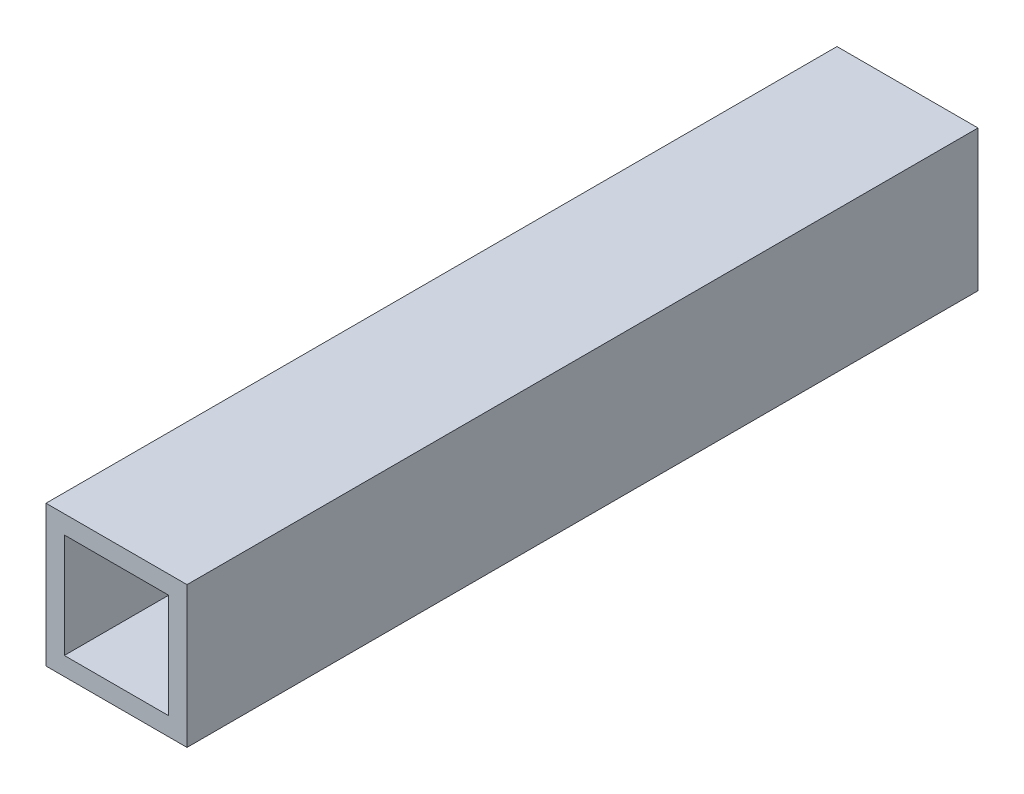
ISO-10303-21;
HEADER;
FILE_DESCRIPTION(('STEP AP214'),'2;1');
FILE_NAME('part.step','',(''),(''),'','','');
FILE_SCHEMA(('AUTOMOTIVE_DESIGN { 1 0 10303 214 1 1 1 1 }'));
ENDSEC;
DATA;
#1=APPLICATION_CONTEXT('core data for automotive mechanical design processes');
#2=APPLICATION_PROTOCOL_DEFINITION('international standard','automotive_design',2000,#1);
#3=PRODUCT_CONTEXT('',#1,'mechanical');
#4=PRODUCT('Part','Part','',(#3));
#5=PRODUCT_RELATED_PRODUCT_CATEGORY('part','',(#4));
#6=PRODUCT_DEFINITION_FORMATION('','',#4);
#7=PRODUCT_DEFINITION_CONTEXT('part definition',#1,'design');
#8=PRODUCT_DEFINITION('design','',#6,#7);
#9=PRODUCT_DEFINITION_SHAPE('','',#8);
#10=(LENGTH_UNIT() NAMED_UNIT(*) SI_UNIT(.MILLI.,.METRE.));
#11=(NAMED_UNIT(*) PLANE_ANGLE_UNIT() SI_UNIT($,.RADIAN.));
#12=(NAMED_UNIT(*) SI_UNIT($,.STERADIAN.) SOLID_ANGLE_UNIT());
#13=UNCERTAINTY_MEASURE_WITH_UNIT(LENGTH_MEASURE(1.E-05),#10,'distance_accuracy_value','');
#14=(GEOMETRIC_REPRESENTATION_CONTEXT(3) GLOBAL_UNCERTAINTY_ASSIGNED_CONTEXT((#13)) GLOBAL_UNIT_ASSIGNED_CONTEXT((#10,
#11,#12)) REPRESENTATION_CONTEXT('',''));
#15=CARTESIAN_POINT('',(0.,0.,0.));
#16=DIRECTION('',(0.,0.,1.));
#17=DIRECTION('',(1.,0.,0.));
#18=AXIS2_PLACEMENT_3D('',#15,#16,#17);
#19=CARTESIAN_POINT('',(0.,0.,71.24));
#20=DIRECTION('',(0.,0.,-1.));
#21=DIRECTION('',(-1.,0.,0.));
#22=AXIS2_PLACEMENT_3D('',#19,#20,#21);
#23=PLANE('',#22);
#24=DIRECTION('',(0.,-1.,0.));
#25=VECTOR('',#24,1.);
#26=CARTESIAN_POINT('',(-6.35,6.35,71.24));
#27=LINE('',#26,#25);
#28=CARTESIAN_POINT('',(-6.35,6.35,71.24));
#29=VERTEX_POINT('',#28);
#30=CARTESIAN_POINT('',(-6.35,-6.35,71.24));
#31=VERTEX_POINT('',#30);
#32=EDGE_CURVE('E134',#29,#31,#27,.T.);
#33=ORIENTED_EDGE('',*,*,#32,.T.);
#34=DIRECTION('',(1.,0.,0.));
#35=VECTOR('',#34,1.);
#36=CARTESIAN_POINT('',(6.35,-6.35,71.24));
#37=LINE('',#36,#35);
#38=CARTESIAN_POINT('',(6.35,-6.35,71.24));
#39=VERTEX_POINT('',#38);
#40=EDGE_CURVE('E137',#31,#39,#37,.T.);
#41=ORIENTED_EDGE('',*,*,#40,.T.);
#42=DIRECTION('',(0.,1.,0.));
#43=VECTOR('',#42,1.);
#44=CARTESIAN_POINT('',(6.35,6.35,71.24));
#45=LINE('',#44,#43);
#46=CARTESIAN_POINT('',(6.35,6.35,71.24));
#47=VERTEX_POINT('',#46);
#48=EDGE_CURVE('E140',#39,#47,#45,.T.);
#49=ORIENTED_EDGE('',*,*,#48,.T.);
#50=DIRECTION('',(-1.,0.,0.));
#51=VECTOR('',#50,1.);
#52=CARTESIAN_POINT('',(6.35,6.35,71.24));
#53=LINE('',#52,#51);
#54=EDGE_CURVE('E142',#47,#29,#53,.T.);
#55=ORIENTED_EDGE('',*,*,#54,.T.);
#56=EDGE_LOOP('',(#33,#41,#49,#55));
#57=FACE_BOUND('',#56,.T.);
#58=DIRECTION('',(0.,-1.,0.));
#59=VECTOR('',#58,1.);
#60=CARTESIAN_POINT('',(-4.7,4.7,71.24));
#61=LINE('',#60,#59);
#62=CARTESIAN_POINT('',(-4.7,4.7,71.24));
#63=VERTEX_POINT('',#62);
#64=CARTESIAN_POINT('',(-4.7,-4.7,71.24));
#65=VERTEX_POINT('',#64);
#66=EDGE_CURVE('E98',#63,#65,#61,.T.);
#67=ORIENTED_EDGE('',*,*,#66,.F.);
#68=DIRECTION('',(-1.,0.,0.));
#69=VECTOR('',#68,1.);
#70=CARTESIAN_POINT('',(4.7,4.7,71.24));
#71=LINE('',#70,#69);
#72=CARTESIAN_POINT('',(4.7,4.7,71.24));
#73=VERTEX_POINT('',#72);
#74=EDGE_CURVE('E120',#73,#63,#71,.T.);
#75=ORIENTED_EDGE('',*,*,#74,.F.);
#76=DIRECTION('',(0.,1.,0.));
#77=VECTOR('',#76,1.);
#78=CARTESIAN_POINT('',(4.7,4.7,71.24));
#79=LINE('',#78,#77);
#80=CARTESIAN_POINT('',(4.7,-4.7,71.24));
#81=VERTEX_POINT('',#80);
#82=EDGE_CURVE('E118',#81,#73,#79,.T.);
#83=ORIENTED_EDGE('',*,*,#82,.F.);
#84=DIRECTION('',(1.,0.,0.));
#85=VECTOR('',#84,1.);
#86=CARTESIAN_POINT('',(4.7,-4.7,71.24));
#87=LINE('',#86,#85);
#88=EDGE_CURVE('E106',#65,#81,#87,.T.);
#89=ORIENTED_EDGE('',*,*,#88,.F.);
#90=EDGE_LOOP('',(#67,#75,#83,#89));
#91=FACE_BOUND('',#90,.T.);
#92=ADVANCED_FACE('F33',(#57,#91),#23,.F.);
#93=CARTESIAN_POINT('',(0.,0.,0.));
#94=DIRECTION('',(0.,0.,-1.));
#95=DIRECTION('',(-1.,0.,0.));
#96=AXIS2_PLACEMENT_3D('',#93,#94,#95);
#97=PLANE('',#96);
#98=DIRECTION('',(0.,-1.,0.));
#99=VECTOR('',#98,1.);
#100=CARTESIAN_POINT('',(-6.35,6.35,0.));
#101=LINE('',#100,#99);
#102=CARTESIAN_POINT('',(-6.35,6.35,0.));
#103=VERTEX_POINT('',#102);
#104=CARTESIAN_POINT('',(-6.35,-6.35,0.));
#105=VERTEX_POINT('',#104);
#106=EDGE_CURVE('E114',#103,#105,#101,.T.);
#107=ORIENTED_EDGE('',*,*,#106,.F.);
#108=DIRECTION('',(-1.,0.,0.));
#109=VECTOR('',#108,1.);
#110=CARTESIAN_POINT('',(6.35,6.35,0.));
#111=LINE('',#110,#109);
#112=CARTESIAN_POINT('',(6.35,6.35,0.));
#113=VERTEX_POINT('',#112);
#114=EDGE_CURVE('E138',#113,#103,#111,.T.);
#115=ORIENTED_EDGE('',*,*,#114,.F.);
#116=DIRECTION('',(0.,1.,0.));
#117=VECTOR('',#116,1.);
#118=CARTESIAN_POINT('',(6.35,6.35,0.));
#119=LINE('',#118,#117);
#120=CARTESIAN_POINT('',(6.35,-6.35,0.));
#121=VERTEX_POINT('',#120);
#122=EDGE_CURVE('E149',#121,#113,#119,.T.);
#123=ORIENTED_EDGE('',*,*,#122,.F.);
#124=DIRECTION('',(1.,0.,0.));
#125=VECTOR('',#124,1.);
#126=CARTESIAN_POINT('',(6.35,-6.35,0.));
#127=LINE('',#126,#125);
#128=EDGE_CURVE('E147',#105,#121,#127,.T.);
#129=ORIENTED_EDGE('',*,*,#128,.F.);
#130=EDGE_LOOP('',(#107,#115,#123,#129));
#131=FACE_BOUND('',#130,.T.);
#132=DIRECTION('',(-1.,0.,0.));
#133=VECTOR('',#132,1.);
#134=CARTESIAN_POINT('',(4.7,4.7,0.));
#135=LINE('',#134,#133);
#136=CARTESIAN_POINT('',(4.7,4.7,0.));
#137=VERTEX_POINT('',#136);
#138=CARTESIAN_POINT('',(-4.7,4.7,0.));
#139=VERTEX_POINT('',#138);
#140=EDGE_CURVE('E107',#137,#139,#135,.T.);
#141=ORIENTED_EDGE('',*,*,#140,.T.);
#142=DIRECTION('',(0.,-1.,0.));
#143=VECTOR('',#142,1.);
#144=CARTESIAN_POINT('',(-4.7,4.7,0.));
#145=LINE('',#144,#143);
#146=CARTESIAN_POINT('',(-4.7,-4.7,0.));
#147=VERTEX_POINT('',#146);
#148=EDGE_CURVE('E56',#139,#147,#145,.T.);
#149=ORIENTED_EDGE('',*,*,#148,.T.);
#150=DIRECTION('',(1.,0.,0.));
#151=VECTOR('',#150,1.);
#152=CARTESIAN_POINT('',(4.7,-4.7,0.));
#153=LINE('',#152,#151);
#154=CARTESIAN_POINT('',(4.7,-4.7,0.));
#155=VERTEX_POINT('',#154);
#156=EDGE_CURVE('E113',#147,#155,#153,.T.);
#157=ORIENTED_EDGE('',*,*,#156,.T.);
#158=DIRECTION('',(0.,1.,0.));
#159=VECTOR('',#158,1.);
#160=CARTESIAN_POINT('',(4.7,4.7,0.));
#161=LINE('',#160,#159);
#162=EDGE_CURVE('E126',#155,#137,#161,.T.);
#163=ORIENTED_EDGE('',*,*,#162,.T.);
#164=EDGE_LOOP('',(#141,#149,#157,#163));
#165=FACE_BOUND('',#164,.T.);
#166=ADVANCED_FACE('F167',(#131,#165),#97,.T.);
#167=CARTESIAN_POINT('',(-6.35,6.35,71.24));
#168=DIRECTION('',(1.,0.,0.));
#169=DIRECTION('',(0.,1.,0.));
#170=AXIS2_PLACEMENT_3D('',#167,#168,#169);
#171=PLANE('',#170);
#172=ORIENTED_EDGE('',*,*,#106,.T.);
#173=DIRECTION('',(0.,0.,-1.));
#174=VECTOR('',#173,1.);
#175=CARTESIAN_POINT('',(-6.35,-6.35,71.24));
#176=LINE('',#175,#174);
#177=EDGE_CURVE('E11',#31,#105,#176,.T.);
#178=ORIENTED_EDGE('',*,*,#177,.F.);
#179=ORIENTED_EDGE('',*,*,#32,.F.);
#180=DIRECTION('',(0.,0.,-1.));
#181=VECTOR('',#180,1.);
#182=CARTESIAN_POINT('',(-6.35,6.35,71.24));
#183=LINE('',#182,#181);
#184=EDGE_CURVE('E144',#29,#103,#183,.T.);
#185=ORIENTED_EDGE('',*,*,#184,.T.);
#186=EDGE_LOOP('',(#172,#178,#179,#185));
#187=FACE_BOUND('',#186,.T.);
#188=ADVANCED_FACE('F35',(#187),#171,.F.);
#189=CARTESIAN_POINT('',(6.35,-6.35,71.24));
#190=DIRECTION('',(0.,1.,0.));
#191=DIRECTION('',(-1.,0.,0.));
#192=AXIS2_PLACEMENT_3D('',#189,#190,#191);
#193=PLANE('',#192);
#194=ORIENTED_EDGE('',*,*,#128,.T.);
#195=DIRECTION('',(0.,0.,-1.));
#196=VECTOR('',#195,1.);
#197=CARTESIAN_POINT('',(6.35,-6.35,71.24));
#198=LINE('',#197,#196);
#199=EDGE_CURVE('E41',#39,#121,#198,.T.);
#200=ORIENTED_EDGE('',*,*,#199,.F.);
#201=ORIENTED_EDGE('',*,*,#40,.F.);
#202=ORIENTED_EDGE('',*,*,#177,.T.);
#203=EDGE_LOOP('',(#194,#200,#201,#202));
#204=FACE_BOUND('',#203,.T.);
#205=ADVANCED_FACE('F177',(#204),#193,.F.);
#206=CARTESIAN_POINT('',(6.35,6.35,71.24));
#207=DIRECTION('',(-1.,0.,0.));
#208=DIRECTION('',(0.,-1.,0.));
#209=AXIS2_PLACEMENT_3D('',#206,#207,#208);
#210=PLANE('',#209);
#211=ORIENTED_EDGE('',*,*,#122,.T.);
#212=DIRECTION('',(0.,0.,-1.));
#213=VECTOR('',#212,1.);
#214=CARTESIAN_POINT('',(6.35,6.35,71.24));
#215=LINE('',#214,#213);
#216=EDGE_CURVE('E154',#47,#113,#215,.T.);
#217=ORIENTED_EDGE('',*,*,#216,.F.);
#218=ORIENTED_EDGE('',*,*,#48,.F.);
#219=ORIENTED_EDGE('',*,*,#199,.T.);
#220=EDGE_LOOP('',(#211,#217,#218,#219));
#221=FACE_BOUND('',#220,.T.);
#222=ADVANCED_FACE('F161',(#221),#210,.F.);
#223=CARTESIAN_POINT('',(6.35,6.35,71.24));
#224=DIRECTION('',(0.,-1.,0.));
#225=DIRECTION('',(1.,0.,0.));
#226=AXIS2_PLACEMENT_3D('',#223,#224,#225);
#227=PLANE('',#226);
#228=ORIENTED_EDGE('',*,*,#114,.T.);
#229=ORIENTED_EDGE('',*,*,#184,.F.);
#230=ORIENTED_EDGE('',*,*,#54,.F.);
#231=ORIENTED_EDGE('',*,*,#216,.T.);
#232=EDGE_LOOP('',(#228,#229,#230,#231));
#233=FACE_BOUND('',#232,.T.);
#234=ADVANCED_FACE('F171',(#233),#227,.F.);
#235=CARTESIAN_POINT('',(-4.7,4.7,71.24));
#236=DIRECTION('',(1.,0.,0.));
#237=DIRECTION('',(0.,1.,0.));
#238=AXIS2_PLACEMENT_3D('',#235,#236,#237);
#239=PLANE('',#238);
#240=ORIENTED_EDGE('',*,*,#148,.F.);
#241=DIRECTION('',(0.,0.,-1.));
#242=VECTOR('',#241,1.);
#243=CARTESIAN_POINT('',(-4.7,4.7,71.24));
#244=LINE('',#243,#242);
#245=EDGE_CURVE('E102',#63,#139,#244,.T.);
#246=ORIENTED_EDGE('',*,*,#245,.F.);
#247=ORIENTED_EDGE('',*,*,#66,.T.);
#248=DIRECTION('',(0.,0.,-1.));
#249=VECTOR('',#248,1.);
#250=CARTESIAN_POINT('',(-4.7,-4.7,71.24));
#251=LINE('',#250,#249);
#252=EDGE_CURVE('E101',#65,#147,#251,.T.);
#253=ORIENTED_EDGE('',*,*,#252,.T.);
#254=EDGE_LOOP('',(#240,#246,#247,#253));
#255=FACE_BOUND('',#254,.T.);
#256=ADVANCED_FACE('F100',(#255),#239,.T.);
#257=CARTESIAN_POINT('',(4.7,-4.7,71.24));
#258=DIRECTION('',(0.,1.,0.));
#259=DIRECTION('',(-1.,0.,0.));
#260=AXIS2_PLACEMENT_3D('',#257,#258,#259);
#261=PLANE('',#260);
#262=ORIENTED_EDGE('',*,*,#156,.F.);
#263=ORIENTED_EDGE('',*,*,#252,.F.);
#264=ORIENTED_EDGE('',*,*,#88,.T.);
#265=DIRECTION('',(0.,0.,-1.));
#266=VECTOR('',#265,1.);
#267=CARTESIAN_POINT('',(4.7,-4.7,71.24));
#268=LINE('',#267,#266);
#269=EDGE_CURVE('E115',#81,#155,#268,.T.);
#270=ORIENTED_EDGE('',*,*,#269,.T.);
#271=EDGE_LOOP('',(#262,#263,#264,#270));
#272=FACE_BOUND('',#271,.T.);
#273=ADVANCED_FACE('F110',(#272),#261,.T.);
#274=CARTESIAN_POINT('',(4.7,4.7,71.24));
#275=DIRECTION('',(-1.,0.,0.));
#276=DIRECTION('',(0.,-1.,0.));
#277=AXIS2_PLACEMENT_3D('',#274,#275,#276);
#278=PLANE('',#277);
#279=ORIENTED_EDGE('',*,*,#162,.F.);
#280=ORIENTED_EDGE('',*,*,#269,.F.);
#281=ORIENTED_EDGE('',*,*,#82,.T.);
#282=DIRECTION('',(0.,0.,-1.));
#283=VECTOR('',#282,1.);
#284=CARTESIAN_POINT('',(4.7,4.7,71.24));
#285=LINE('',#284,#283);
#286=EDGE_CURVE('E48',#73,#137,#285,.T.);
#287=ORIENTED_EDGE('',*,*,#286,.T.);
#288=EDGE_LOOP('',(#279,#280,#281,#287));
#289=FACE_BOUND('',#288,.T.);
#290=ADVANCED_FACE('F200',(#289),#278,.T.);
#291=CARTESIAN_POINT('',(4.7,4.7,71.24));
#292=DIRECTION('',(0.,-1.,0.));
#293=DIRECTION('',(1.,0.,0.));
#294=AXIS2_PLACEMENT_3D('',#291,#292,#293);
#295=PLANE('',#294);
#296=ORIENTED_EDGE('',*,*,#140,.F.);
#297=ORIENTED_EDGE('',*,*,#286,.F.);
#298=ORIENTED_EDGE('',*,*,#74,.T.);
#299=ORIENTED_EDGE('',*,*,#245,.T.);
#300=EDGE_LOOP('',(#296,#297,#298,#299));
#301=FACE_BOUND('',#300,.T.);
#302=ADVANCED_FACE('F204',(#301),#295,.T.);
#303=CLOSED_SHELL('',(#92,#166,#188,#205,#222,#234,#256,#273,#290,#302));
#304=MANIFOLD_SOLID_BREP('B2',#303);
#305=ADVANCED_BREP_SHAPE_REPRESENTATION('',(#18,#304),#14);
#306=SHAPE_DEFINITION_REPRESENTATION(#9,#305);
ENDSEC;
END-ISO-10303-21;
